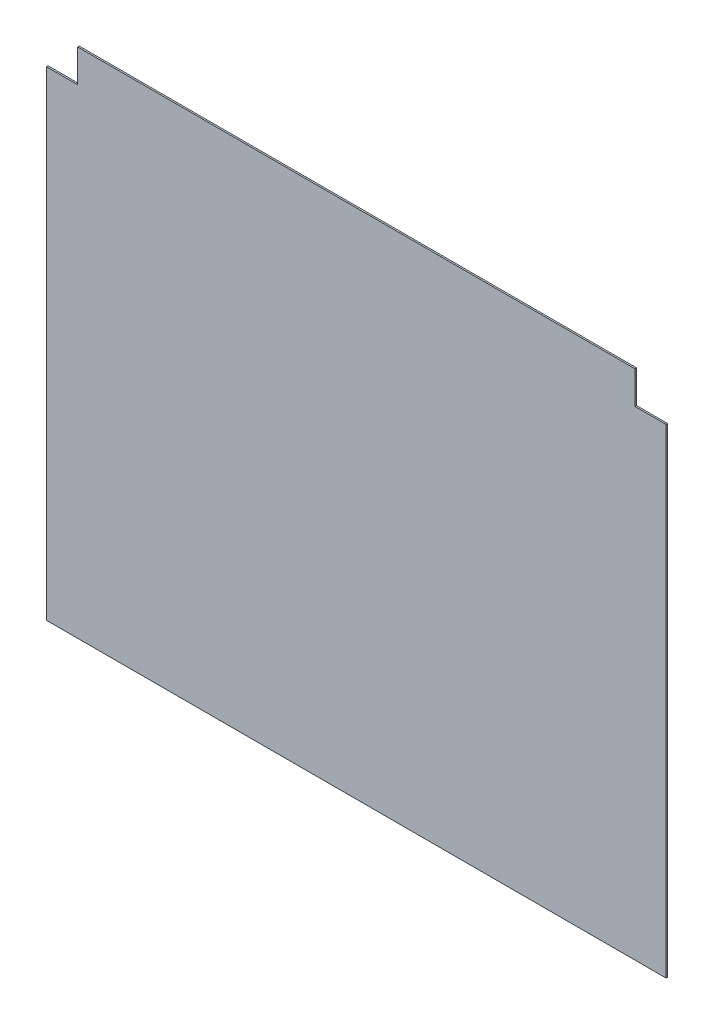
ISO-10303-21;
HEADER;
FILE_DESCRIPTION(('STEP AP214'),'2;1');
FILE_NAME('part.step','',(''),(''),'','','');
FILE_SCHEMA(('AUTOMOTIVE_DESIGN { 1 0 10303 214 1 1 1 1 }'));
ENDSEC;
DATA;
#1=APPLICATION_CONTEXT('core data for automotive mechanical design processes');
#2=APPLICATION_PROTOCOL_DEFINITION('international standard','automotive_design',2000,#1);
#3=PRODUCT_CONTEXT('',#1,'mechanical');
#4=PRODUCT('Part','Part','',(#3));
#5=PRODUCT_RELATED_PRODUCT_CATEGORY('part','',(#4));
#6=PRODUCT_DEFINITION_FORMATION('','',#4);
#7=PRODUCT_DEFINITION_CONTEXT('part definition',#1,'design');
#8=PRODUCT_DEFINITION('design','',#6,#7);
#9=PRODUCT_DEFINITION_SHAPE('','',#8);
#10=(LENGTH_UNIT() NAMED_UNIT(*) SI_UNIT(.MILLI.,.METRE.));
#11=(NAMED_UNIT(*) PLANE_ANGLE_UNIT() SI_UNIT($,.RADIAN.));
#12=(NAMED_UNIT(*) SI_UNIT($,.STERADIAN.) SOLID_ANGLE_UNIT());
#13=UNCERTAINTY_MEASURE_WITH_UNIT(LENGTH_MEASURE(1.E-05),#10,'distance_accuracy_value','');
#14=(GEOMETRIC_REPRESENTATION_CONTEXT(3) GLOBAL_UNCERTAINTY_ASSIGNED_CONTEXT((#13)) GLOBAL_UNIT_ASSIGNED_CONTEXT((#10,
#11,#12)) REPRESENTATION_CONTEXT('',''));
#15=CARTESIAN_POINT('',(0.,0.,0.));
#16=DIRECTION('',(0.,0.,1.));
#17=DIRECTION('',(1.,0.,0.));
#18=AXIS2_PLACEMENT_3D('',#15,#16,#17);
#19=CARTESIAN_POINT('',(378.,308.,1.));
#20=DIRECTION('',(-1.,0.,0.));
#21=DIRECTION('',(0.,0.,1.));
#22=AXIS2_PLACEMENT_3D('',#19,#20,#21);
#23=PLANE('',#22);
#24=DIRECTION('',(0.,1.,0.));
#25=VECTOR('',#24,1.);
#26=CARTESIAN_POINT('',(378.,308.,0.));
#27=LINE('',#26,#25);
#28=CARTESIAN_POINT('',(378.,308.,0.));
#29=VERTEX_POINT('',#28);
#30=CARTESIAN_POINT('',(378.,329.,0.));
#31=VERTEX_POINT('',#30);
#32=EDGE_CURVE('E128',#29,#31,#27,.T.);
#33=ORIENTED_EDGE('',*,*,#32,.T.);
#34=DIRECTION('',(0.,0.,-1.));
#35=VECTOR('',#34,1.);
#36=CARTESIAN_POINT('',(378.,329.,1.));
#37=LINE('',#36,#35);
#38=CARTESIAN_POINT('',(378.,329.,1.));
#39=VERTEX_POINT('',#38);
#40=EDGE_CURVE('E11',#39,#31,#37,.T.);
#41=ORIENTED_EDGE('',*,*,#40,.F.);
#42=DIRECTION('',(0.,1.,0.));
#43=VECTOR('',#42,1.);
#44=CARTESIAN_POINT('',(378.,308.,1.));
#45=LINE('',#44,#43);
#46=CARTESIAN_POINT('',(378.,308.,1.));
#47=VERTEX_POINT('',#46);
#48=EDGE_CURVE('E142',#47,#39,#45,.T.);
#49=ORIENTED_EDGE('',*,*,#48,.F.);
#50=DIRECTION('',(0.,0.,-1.));
#51=VECTOR('',#50,1.);
#52=CARTESIAN_POINT('',(378.,308.,1.));
#53=LINE('',#52,#51);
#54=EDGE_CURVE('E124',#47,#29,#53,.T.);
#55=ORIENTED_EDGE('',*,*,#54,.T.);
#56=EDGE_LOOP('',(#33,#41,#49,#55));
#57=FACE_BOUND('',#56,.T.);
#58=ADVANCED_FACE('F32',(#57),#23,.F.);
#59=CARTESIAN_POINT('',(378.,329.,1.));
#60=DIRECTION('',(0.,-1.,0.));
#61=DIRECTION('',(1.,0.,0.));
#62=AXIS2_PLACEMENT_3D('',#59,#60,#61);
#63=PLANE('',#62);
#64=DIRECTION('',(-1.,0.,0.));
#65=VECTOR('',#64,1.);
#66=CARTESIAN_POINT('',(378.,329.,0.));
#67=LINE('',#66,#65);
#68=CARTESIAN_POINT('',(20.,329.,0.));
#69=VERTEX_POINT('',#68);
#70=EDGE_CURVE('E131',#31,#69,#67,.T.);
#71=ORIENTED_EDGE('',*,*,#70,.T.);
#72=DIRECTION('',(0.,0.,-1.));
#73=VECTOR('',#72,1.);
#74=CARTESIAN_POINT('',(20.,329.,1.));
#75=LINE('',#74,#73);
#76=CARTESIAN_POINT('',(20.,329.,1.));
#77=VERTEX_POINT('',#76);
#78=EDGE_CURVE('E40',#77,#69,#75,.T.);
#79=ORIENTED_EDGE('',*,*,#78,.F.);
#80=DIRECTION('',(-1.,0.,0.));
#81=VECTOR('',#80,1.);
#82=CARTESIAN_POINT('',(378.,329.,1.));
#83=LINE('',#82,#81);
#84=EDGE_CURVE('E91',#39,#77,#83,.T.);
#85=ORIENTED_EDGE('',*,*,#84,.F.);
#86=ORIENTED_EDGE('',*,*,#40,.T.);
#87=EDGE_LOOP('',(#71,#79,#85,#86));
#88=FACE_BOUND('',#87,.T.);
#89=ADVANCED_FACE('F177',(#88),#63,.F.);
#90=CARTESIAN_POINT('',(20.,329.,1.));
#91=DIRECTION('',(1.,0.,0.));
#92=DIRECTION('',(0.,0.,-1.));
#93=AXIS2_PLACEMENT_3D('',#90,#91,#92);
#94=PLANE('',#93);
#95=DIRECTION('',(0.,-1.,0.));
#96=VECTOR('',#95,1.);
#97=CARTESIAN_POINT('',(20.,329.,0.));
#98=LINE('',#97,#96);
#99=CARTESIAN_POINT('',(20.,308.,0.));
#100=VERTEX_POINT('',#99);
#101=EDGE_CURVE('E133',#69,#100,#98,.T.);
#102=ORIENTED_EDGE('',*,*,#101,.T.);
#103=DIRECTION('',(0.,0.,-1.));
#104=VECTOR('',#103,1.);
#105=CARTESIAN_POINT('',(20.,308.,1.));
#106=LINE('',#105,#104);
#107=CARTESIAN_POINT('',(20.,308.,1.));
#108=VERTEX_POINT('',#107);
#109=EDGE_CURVE('E149',#108,#100,#106,.T.);
#110=ORIENTED_EDGE('',*,*,#109,.F.);
#111=DIRECTION('',(0.,-1.,0.));
#112=VECTOR('',#111,1.);
#113=CARTESIAN_POINT('',(20.,329.,1.));
#114=LINE('',#113,#112);
#115=EDGE_CURVE('E157',#77,#108,#114,.T.);
#116=ORIENTED_EDGE('',*,*,#115,.F.);
#117=ORIENTED_EDGE('',*,*,#78,.T.);
#118=EDGE_LOOP('',(#102,#110,#116,#117));
#119=FACE_BOUND('',#118,.T.);
#120=ADVANCED_FACE('F155',(#119),#94,.F.);
#121=CARTESIAN_POINT('',(20.,308.,1.));
#122=DIRECTION('',(0.,-1.,0.));
#123=DIRECTION('',(0.,0.,-1.));
#124=AXIS2_PLACEMENT_3D('',#121,#122,#123);
#125=PLANE('',#124);
#126=DIRECTION('',(-1.,0.,0.));
#127=VECTOR('',#126,1.);
#128=CARTESIAN_POINT('',(20.,308.,0.));
#129=LINE('',#128,#127);
#130=CARTESIAN_POINT('',(0.,308.,0.));
#131=VERTEX_POINT('',#130);
#132=EDGE_CURVE('E135',#100,#131,#129,.T.);
#133=ORIENTED_EDGE('',*,*,#132,.T.);
#134=DIRECTION('',(0.,0.,-1.));
#135=VECTOR('',#134,1.);
#136=CARTESIAN_POINT('',(0.,308.,1.));
#137=LINE('',#136,#135);
#138=CARTESIAN_POINT('',(0.,308.,1.));
#139=VERTEX_POINT('',#138);
#140=EDGE_CURVE('E146',#139,#131,#137,.T.);
#141=ORIENTED_EDGE('',*,*,#140,.F.);
#142=DIRECTION('',(-1.,0.,0.));
#143=VECTOR('',#142,1.);
#144=CARTESIAN_POINT('',(20.,308.,1.));
#145=LINE('',#144,#143);
#146=EDGE_CURVE('E169',#108,#139,#145,.T.);
#147=ORIENTED_EDGE('',*,*,#146,.F.);
#148=ORIENTED_EDGE('',*,*,#109,.T.);
#149=EDGE_LOOP('',(#133,#141,#147,#148));
#150=FACE_BOUND('',#149,.T.);
#151=ADVANCED_FACE('F165',(#150),#125,.F.);
#152=CARTESIAN_POINT('',(0.,308.,1.));
#153=DIRECTION('',(1.,0.,0.));
#154=DIRECTION('',(0.,1.,0.));
#155=AXIS2_PLACEMENT_3D('',#152,#153,#154);
#156=PLANE('',#155);
#157=DIRECTION('',(0.,-1.,0.));
#158=VECTOR('',#157,1.);
#159=CARTESIAN_POINT('',(0.,308.,0.));
#160=LINE('',#159,#158);
#161=CARTESIAN_POINT('',(0.,0.,0.));
#162=VERTEX_POINT('',#161);
#163=EDGE_CURVE('E137',#131,#162,#160,.T.);
#164=ORIENTED_EDGE('',*,*,#163,.T.);
#165=DIRECTION('',(0.,0.,-1.));
#166=VECTOR('',#165,1.);
#167=CARTESIAN_POINT('',(0.,0.,1.));
#168=LINE('',#167,#166);
#169=CARTESIAN_POINT('',(0.,0.,1.));
#170=VERTEX_POINT('',#169);
#171=EDGE_CURVE('E119',#170,#162,#168,.T.);
#172=ORIENTED_EDGE('',*,*,#171,.F.);
#173=DIRECTION('',(0.,-1.,0.));
#174=VECTOR('',#173,1.);
#175=CARTESIAN_POINT('',(0.,308.,1.));
#176=LINE('',#175,#174);
#177=EDGE_CURVE('E110',#139,#170,#176,.T.);
#178=ORIENTED_EDGE('',*,*,#177,.F.);
#179=ORIENTED_EDGE('',*,*,#140,.T.);
#180=EDGE_LOOP('',(#164,#172,#178,#179));
#181=FACE_BOUND('',#180,.T.);
#182=ADVANCED_FACE('F168',(#181),#156,.F.);
#183=CARTESIAN_POINT('',(0.,0.,1.));
#184=DIRECTION('',(0.,1.,0.));
#185=DIRECTION('',(0.,0.,1.));
#186=AXIS2_PLACEMENT_3D('',#183,#184,#185);
#187=PLANE('',#186);
#188=DIRECTION('',(1.,0.,0.));
#189=VECTOR('',#188,1.);
#190=CARTESIAN_POINT('',(0.,0.,0.));
#191=LINE('',#190,#189);
#192=CARTESIAN_POINT('',(398.,0.,0.));
#193=VERTEX_POINT('',#192);
#194=EDGE_CURVE('E118',#162,#193,#191,.T.);
#195=ORIENTED_EDGE('',*,*,#194,.T.);
#196=DIRECTION('',(0.,0.,-1.));
#197=VECTOR('',#196,1.);
#198=CARTESIAN_POINT('',(398.,0.,1.));
#199=LINE('',#198,#197);
#200=CARTESIAN_POINT('',(398.,0.,1.));
#201=VERTEX_POINT('',#200);
#202=EDGE_CURVE('E115',#201,#193,#199,.T.);
#203=ORIENTED_EDGE('',*,*,#202,.F.);
#204=DIRECTION('',(1.,0.,0.));
#205=VECTOR('',#204,1.);
#206=CARTESIAN_POINT('',(0.,0.,1.));
#207=LINE('',#206,#205);
#208=EDGE_CURVE('E104',#170,#201,#207,.T.);
#209=ORIENTED_EDGE('',*,*,#208,.F.);
#210=ORIENTED_EDGE('',*,*,#171,.T.);
#211=EDGE_LOOP('',(#195,#203,#209,#210));
#212=FACE_BOUND('',#211,.T.);
#213=ADVANCED_FACE('F116',(#212),#187,.F.);
#214=CARTESIAN_POINT('',(398.,0.,1.));
#215=DIRECTION('',(-1.,0.,0.));
#216=DIRECTION('',(0.,0.,1.));
#217=AXIS2_PLACEMENT_3D('',#214,#215,#216);
#218=PLANE('',#217);
#219=DIRECTION('',(0.,1.,0.));
#220=VECTOR('',#219,1.);
#221=CARTESIAN_POINT('',(398.,0.,0.));
#222=LINE('',#221,#220);
#223=CARTESIAN_POINT('',(398.,308.,0.));
#224=VERTEX_POINT('',#223);
#225=EDGE_CURVE('E77',#193,#224,#222,.T.);
#226=ORIENTED_EDGE('',*,*,#225,.T.);
#227=DIRECTION('',(0.,0.,-1.));
#228=VECTOR('',#227,1.);
#229=CARTESIAN_POINT('',(398.,308.,1.));
#230=LINE('',#229,#228);
#231=CARTESIAN_POINT('',(398.,308.,1.));
#232=VERTEX_POINT('',#231);
#233=EDGE_CURVE('E120',#232,#224,#230,.T.);
#234=ORIENTED_EDGE('',*,*,#233,.F.);
#235=DIRECTION('',(0.,1.,0.));
#236=VECTOR('',#235,1.);
#237=CARTESIAN_POINT('',(398.,0.,1.));
#238=LINE('',#237,#236);
#239=EDGE_CURVE('E108',#201,#232,#238,.T.);
#240=ORIENTED_EDGE('',*,*,#239,.F.);
#241=ORIENTED_EDGE('',*,*,#202,.T.);
#242=EDGE_LOOP('',(#226,#234,#240,#241));
#243=FACE_BOUND('',#242,.T.);
#244=ADVANCED_FACE('F122',(#243),#218,.F.);
#245=CARTESIAN_POINT('',(398.,308.,1.));
#246=DIRECTION('',(0.,-1.,0.));
#247=DIRECTION('',(0.,0.,-1.));
#248=AXIS2_PLACEMENT_3D('',#245,#246,#247);
#249=PLANE('',#248);
#250=DIRECTION('',(-1.,0.,0.));
#251=VECTOR('',#250,1.);
#252=CARTESIAN_POINT('',(398.,308.,0.));
#253=LINE('',#252,#251);
#254=EDGE_CURVE('E83',#224,#29,#253,.T.);
#255=ORIENTED_EDGE('',*,*,#254,.T.);
#256=ORIENTED_EDGE('',*,*,#54,.F.);
#257=DIRECTION('',(-1.,0.,0.));
#258=VECTOR('',#257,1.);
#259=CARTESIAN_POINT('',(398.,308.,1.));
#260=LINE('',#259,#258);
#261=EDGE_CURVE('E48',#232,#47,#260,.T.);
#262=ORIENTED_EDGE('',*,*,#261,.F.);
#263=ORIENTED_EDGE('',*,*,#233,.T.);
#264=EDGE_LOOP('',(#255,#256,#262,#263));
#265=FACE_BOUND('',#264,.T.);
#266=ADVANCED_FACE('F193',(#265),#249,.F.);
#267=CARTESIAN_POINT('',(0.,0.,1.));
#268=DIRECTION('',(0.,0.,1.));
#269=DIRECTION('',(1.,0.,0.));
#270=AXIS2_PLACEMENT_3D('',#267,#268,#269);
#271=PLANE('',#270);
#272=ORIENTED_EDGE('',*,*,#48,.T.);
#273=ORIENTED_EDGE('',*,*,#84,.T.);
#274=ORIENTED_EDGE('',*,*,#115,.T.);
#275=ORIENTED_EDGE('',*,*,#146,.T.);
#276=ORIENTED_EDGE('',*,*,#177,.T.);
#277=ORIENTED_EDGE('',*,*,#208,.T.);
#278=ORIENTED_EDGE('',*,*,#239,.T.);
#279=ORIENTED_EDGE('',*,*,#261,.T.);
#280=EDGE_LOOP('',(#272,#273,#274,#275,#276,#277,#278,#279));
#281=FACE_BOUND('',#280,.T.);
#282=ADVANCED_FACE('F106',(#281),#271,.T.);
#283=CARTESIAN_POINT('',(0.,0.,0.));
#284=DIRECTION('',(0.,0.,1.));
#285=DIRECTION('',(1.,0.,0.));
#286=AXIS2_PLACEMENT_3D('',#283,#284,#285);
#287=PLANE('',#286);
#288=ORIENTED_EDGE('',*,*,#32,.F.);
#289=ORIENTED_EDGE('',*,*,#254,.F.);
#290=ORIENTED_EDGE('',*,*,#225,.F.);
#291=ORIENTED_EDGE('',*,*,#194,.F.);
#292=ORIENTED_EDGE('',*,*,#163,.F.);
#293=ORIENTED_EDGE('',*,*,#132,.F.);
#294=ORIENTED_EDGE('',*,*,#101,.F.);
#295=ORIENTED_EDGE('',*,*,#70,.F.);
#296=EDGE_LOOP('',(#288,#289,#290,#291,#292,#293,#294,#295));
#297=FACE_BOUND('',#296,.T.);
#298=ADVANCED_FACE('F161',(#297),#287,.F.);
#299=CLOSED_SHELL('',(#58,#89,#120,#151,#182,#213,#244,#266,#282,#298));
#300=MANIFOLD_SOLID_BREP('B2',#299);
#301=ADVANCED_BREP_SHAPE_REPRESENTATION('',(#18,#300),#14);
#302=SHAPE_DEFINITION_REPRESENTATION(#9,#301);
ENDSEC;
END-ISO-10303-21;
